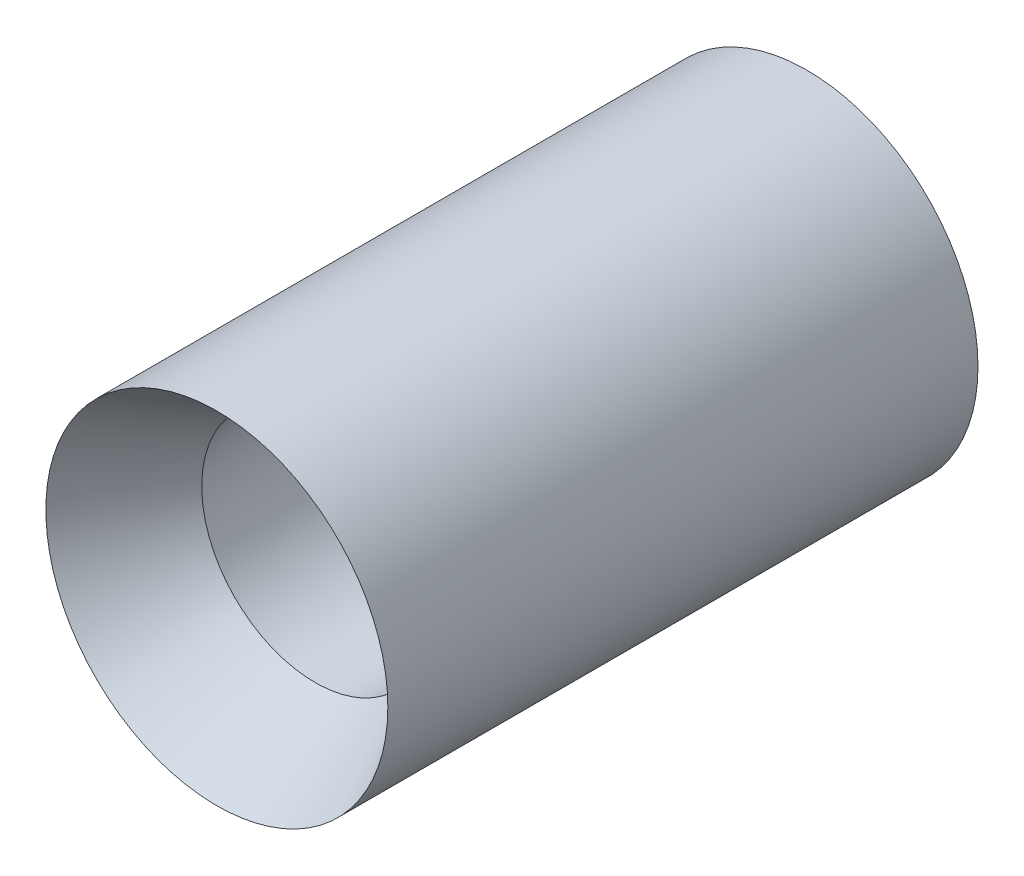
ISO-10303-21;
HEADER;
FILE_DESCRIPTION(('STEP AP214'),'2;1');
FILE_NAME('part.step','',(''),(''),'','','');
FILE_SCHEMA(('AUTOMOTIVE_DESIGN { 1 0 10303 214 1 1 1 1 }'));
ENDSEC;
DATA;
#1=APPLICATION_CONTEXT('core data for automotive mechanical design processes');
#2=APPLICATION_PROTOCOL_DEFINITION('international standard','automotive_design',2000,#1);
#3=PRODUCT_CONTEXT('',#1,'mechanical');
#4=PRODUCT('Part','Part','',(#3));
#5=PRODUCT_RELATED_PRODUCT_CATEGORY('part','',(#4));
#6=PRODUCT_DEFINITION_FORMATION('','',#4);
#7=PRODUCT_DEFINITION_CONTEXT('part definition',#1,'design');
#8=PRODUCT_DEFINITION('design','',#6,#7);
#9=PRODUCT_DEFINITION_SHAPE('','',#8);
#10=(LENGTH_UNIT() NAMED_UNIT(*) SI_UNIT(.MILLI.,.METRE.));
#11=(NAMED_UNIT(*) PLANE_ANGLE_UNIT() SI_UNIT($,.RADIAN.));
#12=(NAMED_UNIT(*) SI_UNIT($,.STERADIAN.) SOLID_ANGLE_UNIT());
#13=UNCERTAINTY_MEASURE_WITH_UNIT(LENGTH_MEASURE(1.E-05),#10,'distance_accuracy_value','');
#14=(GEOMETRIC_REPRESENTATION_CONTEXT(3) GLOBAL_UNCERTAINTY_ASSIGNED_CONTEXT((#13)) GLOBAL_UNIT_ASSIGNED_CONTEXT((#10,
#11,#12)) REPRESENTATION_CONTEXT('',''));
#15=CARTESIAN_POINT('',(0.,0.,0.));
#16=DIRECTION('',(0.,0.,1.));
#17=DIRECTION('',(1.,0.,0.));
#18=AXIS2_PLACEMENT_3D('',#15,#16,#17);
#19=CARTESIAN_POINT('',(0.,0.,0.));
#20=DIRECTION('',(0.,0.,1.));
#21=DIRECTION('',(1.,0.,0.));
#22=AXIS2_PLACEMENT_3D('',#19,#20,#21);
#23=CONICAL_SURFACE('',#22,14.351,0.529030471079648);
#24=CARTESIAN_POINT('',(0.,0.,-8.255));
#25=DIRECTION('',(0.,0.,1.));
#26=DIRECTION('',(1.,0.,0.));
#27=AXIS2_PLACEMENT_3D('',#24,#25,#26);
#28=CIRCLE('',#27,9.525);
#29=CARTESIAN_POINT('',(9.525,0.,-8.255));
#30=VERTEX_POINT('',#29);
#31=EDGE_CURVE('E54',#30,#30,#28,.T.);
#32=ORIENTED_EDGE('',*,*,#31,.F.);
#33=EDGE_LOOP('',(#32));
#34=FACE_BOUND('',#33,.T.);
#35=CARTESIAN_POINT('',(0.,0.,0.));
#36=DIRECTION('',(0.,0.,1.));
#37=DIRECTION('',(1.,0.,0.));
#38=AXIS2_PLACEMENT_3D('',#35,#36,#37);
#39=CIRCLE('',#38,14.351);
#40=CARTESIAN_POINT('',(14.351,0.,0.));
#41=VERTEX_POINT('',#40);
#42=EDGE_CURVE('E10',#41,#41,#39,.T.);
#43=ORIENTED_EDGE('',*,*,#42,.T.);
#44=EDGE_LOOP('',(#43));
#45=FACE_BOUND('',#44,.T.);
#46=ADVANCED_FACE('F35',(#34,#45),#23,.F.);
#47=CARTESIAN_POINT('',(0.,0.,0.));
#48=DIRECTION('',(0.,0.,1.));
#49=DIRECTION('',(1.,0.,0.));
#50=AXIS2_PLACEMENT_3D('',#47,#48,#49);
#51=CYLINDRICAL_SURFACE('',#50,14.351);
#52=ORIENTED_EDGE('',*,*,#42,.F.);
#53=EDGE_LOOP('',(#52));
#54=FACE_BOUND('',#53,.T.);
#55=CARTESIAN_POINT('',(0.,0.,-49.53));
#56=DIRECTION('',(0.,0.,1.));
#57=DIRECTION('',(1.,0.,0.));
#58=AXIS2_PLACEMENT_3D('',#55,#56,#57);
#59=CIRCLE('',#58,14.351);
#60=CARTESIAN_POINT('',(14.351,0.,-49.53));
#61=VERTEX_POINT('',#60);
#62=EDGE_CURVE('E41',#61,#61,#59,.T.);
#63=ORIENTED_EDGE('',*,*,#62,.T.);
#64=EDGE_LOOP('',(#63));
#65=FACE_BOUND('',#64,.T.);
#66=ADVANCED_FACE('F61',(#54,#65),#51,.T.);
#67=CARTESIAN_POINT('',(0.,14.2490695831163,-49.53));
#68=DIRECTION('',(0.,0.,1.));
#69=DIRECTION('',(1.,0.,0.));
#70=AXIS2_PLACEMENT_3D('',#67,#68,#69);
#71=PLANE('',#70);
#72=ORIENTED_EDGE('',*,*,#62,.F.);
#73=EDGE_LOOP('',(#72));
#74=FACE_BOUND('',#73,.T.);
#75=CARTESIAN_POINT('',(0.,0.,-49.53));
#76=DIRECTION('',(0.,0.,1.));
#77=DIRECTION('',(1.,0.,0.));
#78=AXIS2_PLACEMENT_3D('',#75,#76,#77);
#79=CIRCLE('',#78,14.2490695831163);
#80=CARTESIAN_POINT('',(14.2490695831163,0.,-49.53));
#81=VERTEX_POINT('',#80);
#82=EDGE_CURVE('E45',#81,#81,#79,.T.);
#83=ORIENTED_EDGE('',*,*,#82,.T.);
#84=EDGE_LOOP('',(#83));
#85=FACE_BOUND('',#84,.T.);
#86=ADVANCED_FACE('F65',(#74,#85),#71,.F.);
#87=CARTESIAN_POINT('',(0.,0.,-27.305));
#88=DIRECTION('',(0.,0.,-1.));
#89=DIRECTION('',(-1.,0.,0.));
#90=AXIS2_PLACEMENT_3D('',#87,#88,#89);
#91=CONICAL_SURFACE('',#90,9.525,0.20943951023932);
#92=ORIENTED_EDGE('',*,*,#82,.F.);
#93=EDGE_LOOP('',(#92));
#94=FACE_BOUND('',#93,.T.);
#95=CARTESIAN_POINT('',(0.,0.,-27.305));
#96=DIRECTION('',(0.,0.,1.));
#97=DIRECTION('',(1.,0.,0.));
#98=AXIS2_PLACEMENT_3D('',#95,#96,#97);
#99=CIRCLE('',#98,9.525);
#100=CARTESIAN_POINT('',(9.525,0.,-27.305));
#101=VERTEX_POINT('',#100);
#102=EDGE_CURVE('E49',#101,#101,#99,.T.);
#103=ORIENTED_EDGE('',*,*,#102,.T.);
#104=EDGE_LOOP('',(#103));
#105=FACE_BOUND('',#104,.T.);
#106=ADVANCED_FACE('F70',(#94,#105),#91,.F.);
#107=CARTESIAN_POINT('',(0.,0.,0.));
#108=DIRECTION('',(0.,0.,1.));
#109=DIRECTION('',(1.,0.,0.));
#110=AXIS2_PLACEMENT_3D('',#107,#108,#109);
#111=CYLINDRICAL_SURFACE('',#110,9.525);
#112=ORIENTED_EDGE('',*,*,#102,.F.);
#113=EDGE_LOOP('',(#112));
#114=FACE_BOUND('',#113,.T.);
#115=ORIENTED_EDGE('',*,*,#31,.T.);
#116=EDGE_LOOP('',(#115));
#117=FACE_BOUND('',#116,.T.);
#118=ADVANCED_FACE('F58',(#114,#117),#111,.F.);
#119=CLOSED_SHELL('',(#46,#66,#86,#106,#118));
#120=MANIFOLD_SOLID_BREP('B2',#119);
#121=ADVANCED_BREP_SHAPE_REPRESENTATION('',(#18,#120),#14);
#122=SHAPE_DEFINITION_REPRESENTATION(#9,#121);
ENDSEC;
END-ISO-10303-21;
